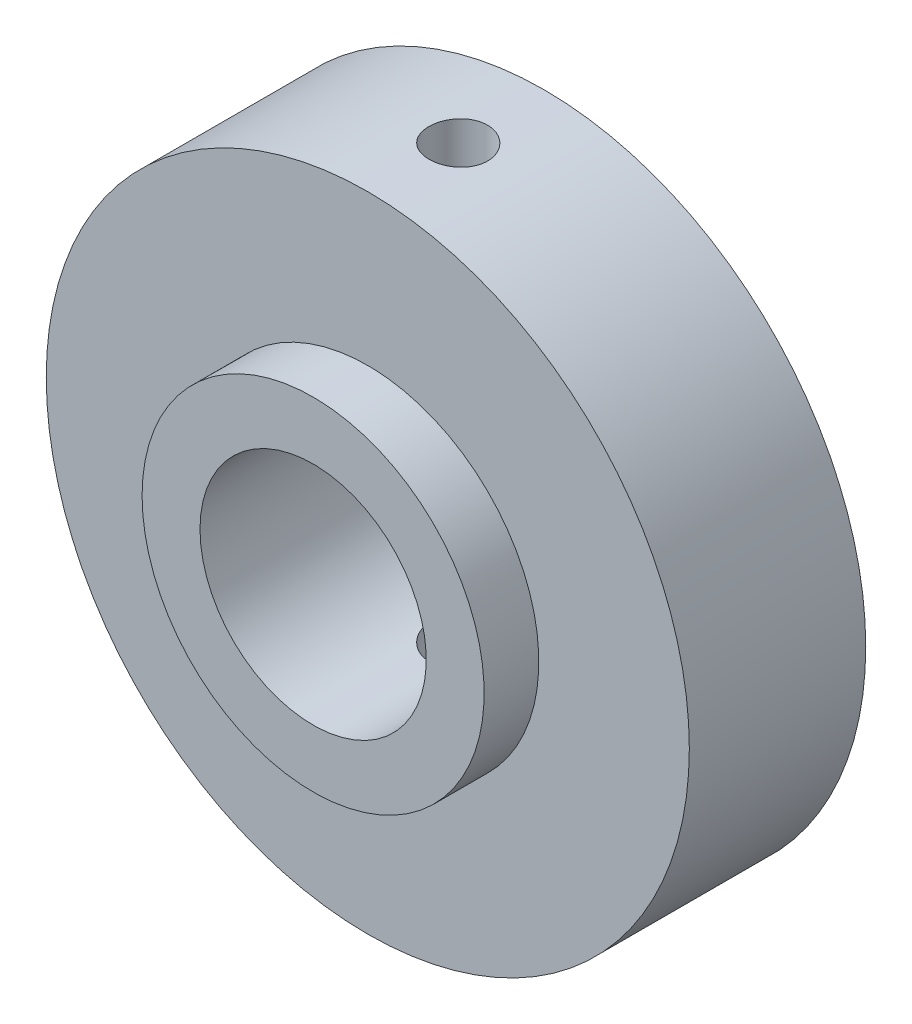
ISO-10303-21;
HEADER;
FILE_DESCRIPTION(('STEP AP214'),'2;1');
FILE_NAME('part.step','',(''),(''),'','','');
FILE_SCHEMA(('AUTOMOTIVE_DESIGN { 1 0 10303 214 1 1 1 1 }'));
ENDSEC;
DATA;
#1=APPLICATION_CONTEXT('core data for automotive mechanical design processes');
#2=APPLICATION_PROTOCOL_DEFINITION('international standard','automotive_design',2000,#1);
#3=PRODUCT_CONTEXT('',#1,'mechanical');
#4=PRODUCT('Part','Part','',(#3));
#5=PRODUCT_RELATED_PRODUCT_CATEGORY('part','',(#4));
#6=PRODUCT_DEFINITION_FORMATION('','',#4);
#7=PRODUCT_DEFINITION_CONTEXT('part definition',#1,'design');
#8=PRODUCT_DEFINITION('design','',#6,#7);
#9=PRODUCT_DEFINITION_SHAPE('','',#8);
#10=(LENGTH_UNIT() NAMED_UNIT(*) SI_UNIT(.MILLI.,.METRE.));
#11=(NAMED_UNIT(*) PLANE_ANGLE_UNIT() SI_UNIT($,.RADIAN.));
#12=(NAMED_UNIT(*) SI_UNIT($,.STERADIAN.) SOLID_ANGLE_UNIT());
#13=UNCERTAINTY_MEASURE_WITH_UNIT(LENGTH_MEASURE(1.E-05),#10,'distance_accuracy_value','');
#14=(GEOMETRIC_REPRESENTATION_CONTEXT(3) GLOBAL_UNCERTAINTY_ASSIGNED_CONTEXT((#13)) GLOBAL_UNIT_ASSIGNED_CONTEXT((#10,
#11,#12)) REPRESENTATION_CONTEXT('',''));
#15=CARTESIAN_POINT('',(0.,0.,0.));
#16=DIRECTION('',(0.,0.,1.));
#17=DIRECTION('',(1.,0.,0.));
#18=AXIS2_PLACEMENT_3D('',#15,#16,#17);
#19=CARTESIAN_POINT('',(2.27939817420907,0.,-19.1299357574621));
#20=DIRECTION('',(0.,0.,-1.));
#21=DIRECTION('',(-1.,0.,0.));
#22=AXIS2_PLACEMENT_3D('',#19,#20,#21);
#23=CYLINDRICAL_SURFACE('',#22,4.2);
#24=CARTESIAN_POINT('',(2.36916450926827,-4.1990406053157,9.97870333006424));
#25=CARTESIAN_POINT('',(2.30908968136473,-4.20032400277502,9.9787019049881));
#26=CARTESIAN_POINT('',(2.24897154958322,-4.20030762760035,9.97373041707249));
#27=CARTESIAN_POINT('',(2.13040617264233,-4.19777602059359,9.95398209989588));
#28=CARTESIAN_POINT('',(2.07195970377911,-4.19525964657695,9.93920078980665));
#29=CARTESIAN_POINT('',(1.95846914340547,-4.1881064901748,9.90032001532521));
#30=CARTESIAN_POINT('',(1.90342139848665,-4.18347203127981,9.87623076599255));
#31=CARTESIAN_POINT('',(1.79812709158779,-4.17267098509535,9.81945358318315));
#32=CARTESIAN_POINT('',(1.74788080260334,-4.16650431076064,9.78676516118075));
#33=CARTESIAN_POINT('',(1.65262811359357,-4.1532535605956,9.71304254123455));
#34=CARTESIAN_POINT('',(1.6077298151895,-4.14615521720557,9.67187125969146));
#35=CARTESIAN_POINT('',(1.5253798956176,-4.1319736542956,9.58264622869984));
#36=CARTESIAN_POINT('',(1.48792916949599,-4.12489043669455,9.53459165321222));
#37=CARTESIAN_POINT('',(1.42089085021547,-4.11146668349222,9.43193974508217));
#38=CARTESIAN_POINT('',(1.39145394560894,-4.10514148848191,9.37724177758254));
#39=CARTESIAN_POINT('',(1.34222372492102,-4.09418420429671,9.2635069717043));
#40=CARTESIAN_POINT('',(1.32242911807727,-4.08955188852595,9.20447071528734));
#41=CARTESIAN_POINT('',(1.2933720470979,-4.0826430249451,9.08475287276733));
#42=CARTESIAN_POINT('',(1.28394225392785,-4.08032910498282,9.02411412159373));
#43=CARTESIAN_POINT('',(1.27536436355381,-4.07822719095206,8.90207457420795));
#44=CARTESIAN_POINT('',(1.27621469213219,-4.07843881014215,8.84067389610984));
#45=CARTESIAN_POINT('',(1.28802559698065,-4.08132505015665,8.72033407883735));
#46=CARTESIAN_POINT('',(1.2987554714041,-4.08394346637875,8.66137072668044));
#47=CARTESIAN_POINT('',(1.32964966893837,-4.09123786438272,8.54610557322644));
#48=CARTESIAN_POINT('',(1.34981465243473,-4.09591399018716,8.48980395853438));
#49=CARTESIAN_POINT('',(1.39919656894562,-4.10680981257123,8.38086220687271));
#50=CARTESIAN_POINT('',(1.42849459147304,-4.11304323334002,8.32826026043802));
#51=CARTESIAN_POINT('',(1.49526219442003,-4.12629203287863,8.22863334042558));
#52=CARTESIAN_POINT('',(1.53273312592336,-4.13330754084337,8.18160929093039));
#53=CARTESIAN_POINT('',(1.61594275572465,-4.14748718122783,8.0931955669194));
#54=CARTESIAN_POINT('',(1.66187053786397,-4.15465045407604,8.0519834747932));
#55=CARTESIAN_POINT('',(1.76009031639784,-4.16806575278619,7.97781401369641));
#56=CARTESIAN_POINT('',(1.8123823489876,-4.17431777346514,7.94485669167619));
#57=CARTESIAN_POINT('',(1.92193151828596,-4.18512171951147,7.88816106749903));
#58=CARTESIAN_POINT('',(1.97918973579682,-4.18967327365269,7.86442477832618));
#59=CARTESIAN_POINT('',(2.09701741089378,-4.19645262959776,7.82694839160082));
#60=CARTESIAN_POINT('',(2.15758619725111,-4.19868090062911,7.81320627572057));
#61=CARTESIAN_POINT('',(2.27857943409387,-4.20042407202745,7.79639951379172));
#62=CARTESIAN_POINT('',(2.33896484972576,-4.20000958670731,7.79306051181343));
#63=CARTESIAN_POINT('',(2.45938216869382,-4.19657397308587,7.79637082335916));
#64=CARTESIAN_POINT('',(2.51941409688746,-4.19355303033067,7.80301942591977));
#65=CARTESIAN_POINT('',(2.63670657995778,-4.18518219965468,7.82591308452826));
#66=CARTESIAN_POINT('',(2.69399136490429,-4.17986001394548,7.84204478931996));
#67=CARTESIAN_POINT('',(2.8050136702795,-4.16735554734001,7.88328627198259));
#68=CARTESIAN_POINT('',(2.85875073775466,-4.16017302950064,7.90839719365582));
#69=CARTESIAN_POINT('',(2.9625116404321,-4.1444149227412,7.96754316678434));
#70=CARTESIAN_POINT('',(3.01242180761567,-4.13581112079475,8.00176998444975));
#71=CARTESIAN_POINT('',(3.10588140824028,-4.11815388594009,8.07793381579824));
#72=CARTESIAN_POINT('',(3.14942955734061,-4.10910036273677,8.11987238245166));
#73=CARTESIAN_POINT('',(3.23015076350118,-4.09118909143285,8.21164193817875));
#74=CARTESIAN_POINT('',(3.26711798305836,-4.08234338360589,8.26165671209048));
#75=CARTESIAN_POINT('',(3.33212060856703,-4.06606722542148,8.36740112010558));
#76=CARTESIAN_POINT('',(3.36015664095555,-4.05863667581896,8.42313035303192));
#77=CARTESIAN_POINT('',(3.40616813304737,-4.04610380317133,8.53818856247262));
#78=CARTESIAN_POINT('',(3.42424297267131,-4.04097857893848,8.59747518371865));
#79=CARTESIAN_POINT('',(3.45012175642673,-4.03355813176165,8.71841573112101));
#80=CARTESIAN_POINT('',(3.45792861678358,-4.03126210530435,8.78006898000568));
#81=CARTESIAN_POINT('',(3.46289001570462,-4.02980797433893,8.90157311699276));
#82=CARTESIAN_POINT('',(3.46042359800638,-4.03053820758169,8.9614074836124));
#83=CARTESIAN_POINT('',(3.44578179290803,-4.03479940482155,9.0797696336979));
#84=CARTESIAN_POINT('',(3.43360667447993,-4.03833029122872,9.13829745331446));
#85=CARTESIAN_POINT('',(3.40010311077831,-4.04775460388088,9.25194741592454));
#86=CARTESIAN_POINT('',(3.37884849880001,-4.0536289484755,9.30709301295793));
#87=CARTESIAN_POINT('',(3.32785184893949,-4.06711660915612,9.4130766061428));
#88=CARTESIAN_POINT('',(3.29810841651453,-4.0747302109261,9.46391389274425));
#89=CARTESIAN_POINT('',(3.22985568589694,-4.09119774538395,9.56161551088891));
#90=CARTESIAN_POINT('',(3.19109380780374,-4.10008384932171,9.60829797555299));
#91=CARTESIAN_POINT('',(3.10639919637252,-4.11800193372561,9.69461424584946));
#92=CARTESIAN_POINT('',(3.06046451821956,-4.12703395315769,9.73424613355322));
#93=CARTESIAN_POINT('',(2.96132105885069,-4.14458402477285,9.80634221039977));
#94=CARTESIAN_POINT('',(2.90795591001991,-4.15308294967174,9.838596457779));
#95=CARTESIAN_POINT('',(2.79634572964744,-4.1684444126604,9.89361929298926));
#96=CARTESIAN_POINT('',(2.73810383073173,-4.17530799049695,9.91639391484439));
#97=CARTESIAN_POINT('',(2.6282712006954,-4.18578719121034,9.94880444574513));
#98=CARTESIAN_POINT('',(2.57716473610335,-4.18975155754744,9.95998644187686));
#99=CARTESIAN_POINT('',(2.47377121227886,-4.19581930044424,9.97493609717934));
#100=CARTESIAN_POINT('',(2.42148428343143,-4.19792288151064,9.97870457117744));
#101=CARTESIAN_POINT('',(2.36916450926827,-4.1990406053157,9.97870333006424));
#102=B_SPLINE_CURVE_WITH_KNOTS('',3,(#24,#25,#26,#27,#28,#29,#30,#31,#32,#33,#34,#35,#36,#37,
#38,#39,#40,#41,#42,#43,#44,#45,#46,#47,#48,#49,#50,#51,#52,#53,#54,#55,#56,#57,#58,#59,#60,#61,
#62,#63,#64,#65,#66,#67,#68,#69,#70,#71,#72,#73,#74,#75,#76,#77,#78,#79,#80,#81,#82,#83,#84,#85,
#86,#87,#88,#89,#90,#91,#92,#93,#94,#95,#96,#97,#98,#99,#100,#101),.UNSPECIFIED.,.T.,.F.,(4,2,2,
2,2,2,2,2,2,2,2,2,2,2,2,2,2,2,2,2,2,2,2,2,2,2,2,2,2,2,2,2,2,2,2,2,2,2,4),(0.,0.18007502558314,
0.360232360620954,0.540192539799766,0.720162944864024,0.903308922547161,1.08647689735608,
1.27288252282498,1.45926318831693,1.64258860923645,1.82588595748712,2.00500871062745,
2.18414400286769,2.36491740179744,2.54572070750449,2.7312092354465,2.9166988183609,
3.10222887158286,3.28772144651613,3.4682788260334,3.64882335325884,3.8272524988207,
4.00570438137812,4.18825594662214,4.37084431392734,4.55840360166187,4.74594973101549,
4.93158923491582,5.11717600364788,5.29597717218504,5.47477338734661,5.65214253269197,
5.82954083301488,6.01268137359802,6.1958716569443,6.38376108135353,6.57153072576801,
6.72837712376708,6.88520628166433),.UNSPECIFIED.);
#103=CARTESIAN_POINT('',(2.36916450926827,-4.1990406053157,9.97870333006424));
#104=VERTEX_POINT('',#103);
#105=EDGE_CURVE('E81',#104,#104,#102,.T.);
#106=ORIENTED_EDGE('',*,*,#105,.T.);
#107=EDGE_LOOP('',(#106));
#108=FACE_BOUND('',#107,.T.);
#109=CARTESIAN_POINT('',(2.36916450926827,4.1990406053157,9.97870333006424));
#110=CARTESIAN_POINT('',(2.42963757968901,4.1977467786429,9.97870167914722));
#111=CARTESIAN_POINT('',(2.49010053717603,4.19513524614943,9.97366386263455));
#112=CARTESIAN_POINT('',(2.60923052145571,4.18745517896644,9.95370601930152));
#113=CARTESIAN_POINT('',(2.66789649569843,4.18238523249667,9.93878031240942));
#114=CARTESIAN_POINT('',(2.78169851662806,4.17024775006006,9.8995844408794));
#115=CARTESIAN_POINT('',(2.83683939855755,4.16318302563462,9.87532741096685));
#116=CARTESIAN_POINT('',(2.94225001543771,4.14770650765819,9.81820552063047));
#117=CARTESIAN_POINT('',(2.99251950654273,4.13929464672988,9.78534022961029));
#118=CARTESIAN_POINT('',(3.08799274637297,4.12172114704041,9.71107852714241));
#119=CARTESIAN_POINT('',(3.13306033796131,4.11254706469467,9.6695099677626));
#120=CARTESIAN_POINT('',(3.21565766066102,4.09453405393278,9.57938648938593));
#121=CARTESIAN_POINT('',(3.25318646394805,4.08569516687872,9.53083071170898));
#122=CARTESIAN_POINT('',(3.32015244002187,4.06915729329956,9.42722566028378));
#123=CARTESIAN_POINT('',(3.34946572721571,4.06147649095841,9.37209317986088));
#124=CARTESIAN_POINT('',(3.39834043726066,4.04828528297802,9.25742090049817));
#125=CARTESIAN_POINT('',(3.41790401609747,4.04277439755439,9.19788207929479));
#126=CARTESIAN_POINT('',(3.44619881241937,4.03469810835786,9.0778093504345));
#127=CARTESIAN_POINT('',(3.45521083452631,4.0320564917719,9.01734683529807));
#128=CARTESIAN_POINT('',(3.46302367494481,4.02977032275158,8.8957148541486));
#129=CARTESIAN_POINT('',(3.46182655376729,4.03012516554181,8.83454553327888));
#130=CARTESIAN_POINT('',(3.44946310587874,4.03373094921889,8.71519289990132));
#131=CARTESIAN_POINT('',(3.43859913247122,4.03689404868021,8.65697521234267));
#132=CARTESIAN_POINT('',(3.40768999988643,4.04564124481356,8.54322474505815));
#133=CARTESIAN_POINT('',(3.3876440727665,4.05122554398317,8.48769219033585));
#134=CARTESIAN_POINT('',(3.33868433550494,4.06430307616737,8.38007286663711));
#135=CARTESIAN_POINT('',(3.30966117056022,4.07181964474039,8.32803879617269));
#136=CARTESIAN_POINT('',(3.24365715229258,4.08795253916236,8.22947735149101));
#137=CARTESIAN_POINT('',(3.2066746190375,4.09656909702247,8.18295114300073));
#138=CARTESIAN_POINT('',(3.12421633463116,4.11437985561666,8.09494534227759));
#139=CARTESIAN_POINT('',(3.07848038936085,4.12358366560242,8.05371115238587));
#140=CARTESIAN_POINT('',(2.98065448201603,4.14134127758186,7.97944630188174));
#141=CARTESIAN_POINT('',(2.92856408738319,4.14989503526098,7.94641620020094));
#142=CARTESIAN_POINT('',(2.81893823287503,4.16557117218395,7.88927973649752));
#143=CARTESIAN_POINT('',(2.76136183343172,4.17268130992283,7.86524834272776));
#144=CARTESIAN_POINT('',(2.6427500911995,4.18467721890759,7.82729286880445));
#145=CARTESIAN_POINT('',(2.58171547969253,4.18956345846496,7.81336666031983));
#146=CARTESIAN_POINT('',(2.45975780798342,4.19655757585806,7.79637626394917));
#147=CARTESIAN_POINT('',(2.39888011724632,4.1987399012637,7.79301690818159));
#148=CARTESIAN_POINT('',(2.27738081362438,4.20043875335396,7.79647173902724));
#149=CARTESIAN_POINT('',(2.21675916963778,4.19995561370783,7.80328465217381));
#150=CARTESIAN_POINT('',(2.09880011681435,4.19652204615122,7.82662363583095));
#151=CARTESIAN_POINT('',(2.04142074540259,4.193622753232,7.84294630697038));
#152=CARTESIAN_POINT('',(1.93019542057724,4.18582946242053,7.88463747222057));
#153=CARTESIAN_POINT('',(1.87634976193811,4.1809352983655,7.91000671984381));
#154=CARTESIAN_POINT('',(1.77283943879362,4.16967039821049,7.96949034645866));
#155=CARTESIAN_POINT('',(1.72324760264298,4.16327907602823,8.00372742502064));
#156=CARTESIAN_POINT('',(1.63040239550223,4.14982036259361,8.07982152006606));
#157=CARTESIAN_POINT('',(1.58715012806785,4.14275285398765,8.12167986037823));
#158=CARTESIAN_POINT('',(1.50705368273734,4.12858137700463,8.21311330820553));
#159=CARTESIAN_POINT('',(1.47040503488412,4.12148122612512,8.26286055130975));
#160=CARTESIAN_POINT('',(1.40595785709558,4.10830720776388,8.36791780257806));
#161=CARTESIAN_POINT('',(1.37815914960753,4.10223331969381,8.42322769911161));
#162=CARTESIAN_POINT('',(1.33230292768253,4.09189020929714,8.53776969276405));
#163=CARTESIAN_POINT('',(1.31422368204126,4.08761696567746,8.59699270476795));
#164=CARTESIAN_POINT('',(1.28831457621332,4.08141322760478,8.71775508859712));
#165=CARTESIAN_POINT('',(1.28048265390546,4.07948226180895,8.77929399181873));
#166=CARTESIAN_POINT('',(1.27540504021999,4.07823537030298,8.90121509919237));
#167=CARTESIAN_POINT('',(1.27788776667012,4.07885235508206,8.96158544747519));
#168=CARTESIAN_POINT('',(1.29274208848654,4.08247069989533,9.08102035414062));
#169=CARTESIAN_POINT('',(1.3051135003492,4.08547201568365,9.14008493673333));
#170=CARTESIAN_POINT('',(1.33923687247978,4.09345802788351,9.25489994585459));
#171=CARTESIAN_POINT('',(1.36093203961721,4.09843070230153,9.3106681486186));
#172=CARTESIAN_POINT('',(1.4130470315117,4.10976199093292,9.41781359984723));
#173=CARTESIAN_POINT('',(1.44346803434735,4.11612079226,9.46919025419061));
#174=CARTESIAN_POINT('',(1.51304014625929,4.12964619273084,9.56743023602342));
#175=CARTESIAN_POINT('',(1.55238402955395,4.13682856982323,9.61415490656889));
#176=CARTESIAN_POINT('',(1.63832138696516,4.15101356190945,9.70043034275606));
#177=CARTESIAN_POINT('',(1.68491638628581,4.15801613872215,9.73997959531678));
#178=CARTESIAN_POINT('',(1.78488322372274,4.17109465209995,9.81135136608021));
#179=CARTESIAN_POINT('',(1.83834573077305,4.17715521895111,9.84304991182452));
#180=CARTESIAN_POINT('',(1.94999379781954,4.18743660049433,9.89696547621222));
#181=CARTESIAN_POINT('',(2.00817600356906,4.19165870840642,9.9191891594908));
#182=CARTESIAN_POINT('',(2.11673074161061,4.19713467809424,9.95034836453871));
#183=CARTESIAN_POINT('',(2.16660824578125,4.19878774013216,9.96096194982498));
#184=CARTESIAN_POINT('',(2.26738110397591,4.20028501899908,9.97513988298115));
#185=CARTESIAN_POINT('',(2.31827638722346,4.20012936117301,9.97870471931183));
#186=CARTESIAN_POINT('',(2.36916450926827,4.1990406053157,9.97870333006424));
#187=B_SPLINE_CURVE_WITH_KNOTS('',3,(#109,#110,#111,#112,#113,#114,#115,#116,#117,#118,#119,
#120,#121,#122,#123,#124,#125,#126,#127,#128,#129,#130,#131,#132,#133,#134,#135,#136,#137,#138,
#139,#140,#141,#142,#143,#144,#145,#146,#147,#148,#149,#150,#151,#152,#153,#154,#155,#156,#157,
#158,#159,#160,#161,#162,#163,#164,#165,#166,#167,#168,#169,#170,#171,#172,#173,#174,#175,#176,
#177,#178,#179,#180,#181,#182,#183,#184,#185,#186),.UNSPECIFIED.,.T.,.F.,(4,2,2,2,2,2,2,2,2,2,2,
2,2,2,2,2,2,2,2,2,2,2,2,2,2,2,2,2,2,2,2,2,2,2,2,2,2,2,4),(0.,0.18127293963861,0.362650101424274,
0.543772886292683,0.724904732888097,0.910030943724982,1.09517992473422,1.28298665527005,
1.47075183702573,1.65339753443547,1.83600636934507,2.01309693541829,2.19020231535822,
2.36955621103746,2.54894799896733,2.73487092724041,2.92080651867762,3.10825838580576,
3.29567076078042,3.47779934212607,3.65990512470047,3.83825192621125,4.01661358615398,
4.19758887316403,4.37859562599354,4.56430188725696,4.75000442253654,4.9352900105891,
5.12053830693926,5.30094039658354,5.48133913859676,5.66065426766669,5.83999361754852,
6.02365621806359,6.20735750262661,6.39379725210374,6.58010564229205,6.73265749260889,
6.88519877109155),.UNSPECIFIED.);
#188=CARTESIAN_POINT('',(2.36916450926827,4.1990406053157,9.97870333006424));
#189=VERTEX_POINT('',#188);
#190=EDGE_CURVE('E77',#189,#189,#187,.T.);
#191=ORIENTED_EDGE('',*,*,#190,.T.);
#192=EDGE_LOOP('',(#191));
#193=FACE_BOUND('',#192,.T.);
#194=CARTESIAN_POINT('',(2.27939817420908,0.,14.185436756577));
#195=DIRECTION('',(0.,0.,-1.));
#196=DIRECTION('',(-1.,0.,0.));
#197=AXIS2_PLACEMENT_3D('',#194,#195,#196);
#198=CIRCLE('',#197,4.2);
#199=CARTESIAN_POINT('',(-1.92060182579092,0.,14.185436756577));
#200=VERTEX_POINT('',#199);
#201=EDGE_CURVE('E86',#200,#200,#198,.T.);
#202=ORIENTED_EDGE('',*,*,#201,.F.);
#203=EDGE_LOOP('',(#202));
#204=FACE_BOUND('',#203,.T.);
#205=CARTESIAN_POINT('',(2.27939817420908,0.,3.57343675657702));
#206=DIRECTION('',(0.,0.,-1.));
#207=DIRECTION('',(-1.,0.,0.));
#208=AXIS2_PLACEMENT_3D('',#205,#206,#207);
#209=CIRCLE('',#208,4.2);
#210=CARTESIAN_POINT('',(-1.92060182579092,0.,3.57343675657702));
#211=VERTEX_POINT('',#210);
#212=EDGE_CURVE('E51',#211,#211,#209,.T.);
#213=ORIENTED_EDGE('',*,*,#212,.T.);
#214=EDGE_LOOP('',(#213));
#215=FACE_BOUND('',#214,.T.);
#216=ADVANCED_FACE('F36',(#108,#193,#204,#215),#23,.F.);
#217=CARTESIAN_POINT('',(0.,0.,3.57343675657701));
#218=DIRECTION('',(0.,0.,-1.));
#219=DIRECTION('',(-1.,0.,0.));
#220=AXIS2_PLACEMENT_3D('',#217,#218,#219);
#221=PLANE('',#220);
#222=CARTESIAN_POINT('',(2.27939817420908,0.,3.57343675657702));
#223=DIRECTION('',(0.,0.,-1.));
#224=DIRECTION('',(-1.,0.,0.));
#225=AXIS2_PLACEMENT_3D('',#222,#223,#224);
#226=CIRCLE('',#225,6.35);
#227=CARTESIAN_POINT('',(-4.07060182579092,0.,3.57343675657702));
#228=VERTEX_POINT('',#227);
#229=EDGE_CURVE('E55',#228,#228,#226,.T.);
#230=ORIENTED_EDGE('',*,*,#229,.T.);
#231=EDGE_LOOP('',(#230));
#232=FACE_BOUND('',#231,.T.);
#233=ORIENTED_EDGE('',*,*,#212,.F.);
#234=EDGE_LOOP('',(#233));
#235=FACE_BOUND('',#234,.T.);
#236=ADVANCED_FACE('F106',(#232,#235),#221,.T.);
#237=CARTESIAN_POINT('',(2.27939817420907,0.,-19.1299357574621));
#238=DIRECTION('',(0.,0.,-1.));
#239=DIRECTION('',(-1.,0.,0.));
#240=AXIS2_PLACEMENT_3D('',#237,#238,#239);
#241=CYLINDRICAL_SURFACE('',#240,6.35);
#242=ORIENTED_EDGE('',*,*,#229,.F.);
#243=EDGE_LOOP('',(#242));
#244=FACE_BOUND('',#243,.T.);
#245=CARTESIAN_POINT('',(2.27939817420908,0.,5.60543675657701));
#246=DIRECTION('',(0.,0.,-1.));
#247=DIRECTION('',(-1.,0.,0.));
#248=AXIS2_PLACEMENT_3D('',#245,#246,#247);
#249=CIRCLE('',#248,6.35);
#250=CARTESIAN_POINT('',(-4.07060182579092,0.,5.60543675657702));
#251=VERTEX_POINT('',#250);
#252=EDGE_CURVE('E101',#251,#251,#249,.T.);
#253=ORIENTED_EDGE('',*,*,#252,.T.);
#254=EDGE_LOOP('',(#253));
#255=FACE_BOUND('',#254,.T.);
#256=ADVANCED_FACE('F109',(#244,#255),#241,.T.);
#257=CARTESIAN_POINT('',(0.,0.,5.60543675657701));
#258=DIRECTION('',(0.,0.,-1.));
#259=DIRECTION('',(-1.,0.,0.));
#260=AXIS2_PLACEMENT_3D('',#257,#258,#259);
#261=PLANE('',#260);
#262=CARTESIAN_POINT('',(2.27939817420908,0.,5.60543675657701));
#263=DIRECTION('',(0.,0.,-1.));
#264=DIRECTION('',(-1.,0.,0.));
#265=AXIS2_PLACEMENT_3D('',#262,#263,#264);
#266=CIRCLE('',#265,11.938);
#267=CARTESIAN_POINT('',(-9.65860182579092,0.,5.60543675657702));
#268=VERTEX_POINT('',#267);
#269=EDGE_CURVE('E98',#268,#268,#266,.T.);
#270=ORIENTED_EDGE('',*,*,#269,.T.);
#271=EDGE_LOOP('',(#270));
#272=FACE_BOUND('',#271,.T.);
#273=ORIENTED_EDGE('',*,*,#252,.F.);
#274=EDGE_LOOP('',(#273));
#275=FACE_BOUND('',#274,.T.);
#276=ADVANCED_FACE('F112',(#272,#275),#261,.T.);
#277=CARTESIAN_POINT('',(2.27939817420907,0.,-19.1299357574621));
#278=DIRECTION('',(0.,0.,-1.));
#279=DIRECTION('',(-1.,0.,0.));
#280=AXIS2_PLACEMENT_3D('',#277,#278,#279);
#281=CYLINDRICAL_SURFACE('',#280,11.938);
#282=CARTESIAN_POINT('',(2.27939817420908,-11.938,7.7979984632446));
#283=CARTESIAN_POINT('',(2.21837354321615,-11.9379993774013,7.8030336880568));
#284=CARTESIAN_POINT('',(2.15773205568773,-11.937527177792,7.81321611489547));
#285=CARTESIAN_POINT('',(2.03897808763387,-11.9357270956912,7.84360237598854));
#286=CARTESIAN_POINT('',(1.9808685326469,-11.9343982499819,7.86381748515365));
#287=CARTESIAN_POINT('',(1.86890298857663,-11.9310717808842,7.91367697581097));
#288=CARTESIAN_POINT('',(1.81504453131312,-11.9290745491423,7.94331583486896));
#289=CARTESIAN_POINT('',(1.71307524602721,-11.9246690103928,8.01117578479581));
#290=CARTESIAN_POINT('',(1.6649632115341,-11.9222607899316,8.04939506932104));
#291=CARTESIAN_POINT('',(1.57570220152969,-11.9173261794758,8.1334521307457));
#292=CARTESIAN_POINT('',(1.53457146998276,-11.9147995012349,8.17930926677583));
#293=CARTESIAN_POINT('',(1.46058258466666,-11.9099439135921,8.27728393045914));
#294=CARTESIAN_POINT('',(1.42772475466794,-11.9076150119328,8.32940170301236));
#295=CARTESIAN_POINT('',(1.37118904762857,-11.9034368218674,8.43848208787241));
#296=CARTESIAN_POINT('',(1.34752010095949,-11.9015880006104,8.49544934801957));
#297=CARTESIAN_POINT('',(1.31008962415316,-11.8985982471561,8.61256815281294));
#298=CARTESIAN_POINT('',(1.29632788228406,-11.8974572998307,8.67271962937818));
#299=CARTESIAN_POINT('',(1.27913605978165,-11.8960243403076,8.79431635982863));
#300=CARTESIAN_POINT('',(1.27567667574143,-11.8957299203809,8.85575744266387));
#301=CARTESIAN_POINT('',(1.27910697154321,-11.8960188404946,8.9783472672412));
#302=CARTESIAN_POINT('',(1.28599650824907,-11.8966021683948,9.03949601301486));
#303=CARTESIAN_POINT('',(1.30990152311004,-11.8985739436777,9.15964775853648));
#304=CARTESIAN_POINT('',(1.32689809470776,-11.8999608876654,9.21865454697971));
#305=CARTESIAN_POINT('',(1.37051328420284,-11.9033712740333,9.3329781776167));
#306=CARTESIAN_POINT('',(1.39713206324931,-11.9053947270735,9.38829495799322));
#307=CARTESIAN_POINT('',(1.45930437367033,-11.9098387741759,9.4938030822747));
#308=CARTESIAN_POINT('',(1.49487745914295,-11.9122602333207,9.54398286636388));
#309=CARTESIAN_POINT('',(1.57392554888615,-11.9172025354528,9.63767075459034));
#310=CARTESIAN_POINT('',(1.61740069400278,-11.9197233802108,9.68117873978422));
#311=CARTESIAN_POINT('',(1.71115732743075,-11.9245608332105,9.76040489522598));
#312=CARTESIAN_POINT('',(1.76145644206461,-11.9268768860021,9.79610224519218));
#313=CARTESIAN_POINT('',(1.86735344531123,-11.9310044361895,9.85854483159164));
#314=CARTESIAN_POINT('',(1.92295128030824,-11.9328159386899,9.8852901585947));
#315=CARTESIAN_POINT('',(2.03778835152581,-11.9356926904375,9.92902934216155));
#316=CARTESIAN_POINT('',(2.09702237245775,-11.9367589825196,9.94603681965486));
#317=CARTESIAN_POINT('',(2.21751359721404,-11.9379915474381,9.96986573429183));
#318=CARTESIAN_POINT('',(2.27877075221294,-11.9381578419788,9.97668741707175));
#319=CARTESIAN_POINT('',(2.40134538336588,-11.9375339292125,9.97994344685771));
#320=CARTESIAN_POINT('',(2.46266193936078,-11.9367469859564,9.97641318204029));
#321=CARTESIAN_POINT('',(2.58382194490059,-11.9342717788033,9.95914843432179));
#322=CARTESIAN_POINT('',(2.64366539381512,-11.9325835145206,9.94541394705416));
#323=CARTESIAN_POINT('',(2.76019261475005,-11.9284568398096,9.90813940168081));
#324=CARTESIAN_POINT('',(2.81687614874339,-11.9260183729606,9.88459860602338));
#325=CARTESIAN_POINT('',(2.92549150965816,-11.9206278263574,9.82838479872605));
#326=CARTESIAN_POINT('',(2.9774232128635,-11.9176757332365,9.79571154940828));
#327=CARTESIAN_POINT('',(3.07527587309752,-11.9115422706759,9.72201134570343));
#328=CARTESIAN_POINT('',(3.12117295659298,-11.9083600634912,9.68095276137205));
#329=CARTESIAN_POINT('',(3.20543335709697,-11.9021045252017,9.59171339134216));
#330=CARTESIAN_POINT('',(3.24379656677292,-11.8990311956484,9.54353250419173));
#331=CARTESIAN_POINT('',(3.31196992026111,-11.8933097208245,9.44130104994459));
#332=CARTESIAN_POINT('',(3.34176369564197,-11.8906623934499,9.38723951804228));
#333=CARTESIAN_POINT('',(3.39184328803136,-11.8860820158601,9.27485049130036));
#334=CARTESIAN_POINT('',(3.4121293245389,-11.8841489491555,9.21652309497996));
#335=CARTESIAN_POINT('',(3.44255354537586,-11.8812098966247,9.09745470519128));
#336=CARTESIAN_POINT('',(3.4527238842434,-11.8802009740565,9.03672200167438));
#337=CARTESIAN_POINT('',(3.46273100794371,-11.8792084570567,8.91440341179092));
#338=CARTESIAN_POINT('',(3.46256803667739,-11.8792248384245,8.85281754559616));
#339=CARTESIAN_POINT('',(3.45193403483978,-11.8802790822015,8.73078411313256));
#340=CARTESIAN_POINT('',(3.44150145271689,-11.8813131345439,8.67033315803267));
#341=CARTESIAN_POINT('',(3.41068946611037,-11.8842863182276,8.55204547293126));
#342=CARTESIAN_POINT('',(3.39030996340096,-11.8862254585066,8.49420876875163));
#343=CARTESIAN_POINT('',(3.34015831802541,-11.8908058323764,8.38270385406285));
#344=CARTESIAN_POINT('',(3.31037414639805,-11.893447964438,8.32904109236643));
#345=CARTESIAN_POINT('',(3.24226803884449,-11.8991549781606,8.22746604325905));
#346=CARTESIAN_POINT('',(3.20394615961635,-11.9022198570141,8.17955371766326));
#347=CARTESIAN_POINT('',(3.1196581996434,-11.9084674216243,8.09062044244451));
#348=CARTESIAN_POINT('',(3.07366012890061,-11.9116505551355,8.04962984045035));
#349=CARTESIAN_POINT('',(2.97541383996397,-11.9177944365538,7.97593553736555));
#350=CARTESIAN_POINT('',(2.92316414671933,-11.9207551317079,7.94323379770446));
#351=CARTESIAN_POINT('',(2.81381515268114,-11.9261578956922,7.88701683302627));
#352=CARTESIAN_POINT('',(2.75670858180853,-11.9285991671885,7.86351568545912));
#353=CARTESIAN_POINT('',(2.63937410402356,-11.9327152898635,7.82647309489353));
#354=CARTESIAN_POINT('',(2.57914985386562,-11.9343910172543,7.81292025460967));
#355=CARTESIAN_POINT('',(2.47871217625045,-11.9364019306389,7.79907667105389));
#356=CARTESIAN_POINT('',(2.43889087429188,-11.9370011675617,7.79580128938432));
#357=CARTESIAN_POINT('',(2.35912483078674,-11.937800404376,7.79362096444112));
#358=CARTESIAN_POINT('',(2.3191800897368,-11.9380004058717,7.79471600360687));
#359=CARTESIAN_POINT('',(2.27939817420908,-11.938,7.7979984632446));
#360=B_SPLINE_CURVE_WITH_KNOTS('',3,(#282,#283,#284,#285,#286,#287,#288,#289,#290,#291,#292,
#293,#294,#295,#296,#297,#298,#299,#300,#301,#302,#303,#304,#305,#306,#307,#308,#309,#310,#311,
#312,#313,#314,#315,#316,#317,#318,#319,#320,#321,#322,#323,#324,#325,#326,#327,#328,#329,#330,
#331,#332,#333,#334,#335,#336,#337,#338,#339,#340,#341,#342,#343,#344,#345,#346,#347,#348,#349,
#350,#351,#352,#353,#354,#355,#356,#357,#358,#359),.UNSPECIFIED.,.T.,.F.,(4,2,2,2,2,2,2,2,2,2,2,
2,2,2,2,2,2,2,2,2,2,2,2,2,2,2,2,2,2,2,2,2,2,2,2,2,2,2,4),(0.,0.18355022100133,0.367307187769338,
0.550956668534651,0.734567523765373,0.918651051532127,1.10274178252069,1.2870109799755,
1.47127623920402,1.65501688244533,1.83875498438912,2.02215045616177,2.20554899951506,
2.38935157038326,2.57315741766357,2.75744741075222,2.94173553927795,3.12576525892531,
3.30979054051915,3.49318746509739,3.67658446815435,3.85999526735112,4.04341084037402,
4.22753148760019,4.41165475774145,4.59612742003184,4.78059582331142,4.9644759689896,
5.14835177447878,5.33154177458488,5.51473358372773,5.69816065842692,5.8815865150417,
6.06579680281308,6.25005064045603,6.43458530573676,6.61890822736796,6.73856497265333,
6.8582212371511),.UNSPECIFIED.);
#361=CARTESIAN_POINT('',(2.27939817420908,-11.938,7.7979984632446));
#362=VERTEX_POINT('',#361);
#363=EDGE_CURVE('E10',#362,#362,#360,.T.);
#364=ORIENTED_EDGE('',*,*,#363,.T.);
#365=EDGE_LOOP('',(#364));
#366=FACE_BOUND('',#365,.T.);
#367=CARTESIAN_POINT('',(2.36916450926827,11.9376625017249,9.97870333006424));
#368=CARTESIAN_POINT('',(2.30797740911116,11.9381219559611,9.97870067315979));
#369=CARTESIAN_POINT('',(2.24674580438916,11.93810758483,9.97354432711534));
#370=CARTESIAN_POINT('',(2.12597102850619,11.9371672918499,9.95304797164745));
#371=CARTESIAN_POINT('',(2.06642980865939,11.9362403573433,9.93769665517958));
#372=CARTESIAN_POINT('',(1.95080268015766,11.933616881156,9.8972564537437));
#373=CARTESIAN_POINT('',(1.89471484383411,11.9319207733311,9.87217305935077));
#374=CARTESIAN_POINT('',(1.78755585389186,11.9279844817629,9.81299054593427));
#375=CARTESIAN_POINT('',(1.7364836683244,11.9257444102686,9.77889328682723));
#376=CARTESIAN_POINT('',(1.64065240852592,11.920996562786,9.70255042415757));
#377=CARTESIAN_POINT('',(1.5959090312912,11.9184881473679,9.66028515508721));
#378=CARTESIAN_POINT('',(1.5141388741937,11.9135177261128,9.5688478652507));
#379=CARTESIAN_POINT('',(1.47711244642926,11.9110557223981,9.51967552950971));
#380=CARTESIAN_POINT('',(1.41175790225478,11.9064740230656,9.41570198488561));
#381=CARTESIAN_POINT('',(1.383447284999,11.9043550200979,9.36088974293247));
#382=CARTESIAN_POINT('',(1.33643595861451,11.9007237362822,9.24726960605035));
#383=CARTESIAN_POINT('',(1.31773508540562,11.8992114450751,9.18846177936279));
#384=CARTESIAN_POINT('',(1.29051432074305,11.8969803220578,9.06865666878648));
#385=CARTESIAN_POINT('',(1.28197211012326,11.896259751059,9.00766448912594));
#386=CARTESIAN_POINT('',(1.27524263573367,11.8956936596054,8.88510814913568));
#387=CARTESIAN_POINT('',(1.27705517148361,11.8958481222089,8.823543999903));
#388=CARTESIAN_POINT('',(1.29096339826004,11.89701172781,8.70176134608754));
#389=CARTESIAN_POINT('',(1.30303212513787,11.8980186296668,8.64153973753873));
#390=CARTESIAN_POINT('',(1.33706842132474,11.9007624825042,8.52397977130114));
#391=CARTESIAN_POINT('',(1.359036097646,11.9024994413771,8.46664144478942));
#392=CARTESIAN_POINT('',(1.412277467372,11.9064963646394,8.3563896513517));
#393=CARTESIAN_POINT('',(1.44356327940617,11.9087570092482,8.3034820622975));
#394=CARTESIAN_POINT('',(1.51454496288349,11.9135261220995,8.20365835378081));
#395=CARTESIAN_POINT('',(1.55424101039921,11.9160345955298,8.15674235978839));
#396=CARTESIAN_POINT('',(1.64106312386779,11.9210009788029,8.0700826805305));
#397=CARTESIAN_POINT('',(1.68821169616633,11.9234587091277,8.0303615294422));
#398=CARTESIAN_POINT('',(1.78852233290475,11.9280091102504,7.9593948839301));
#399=CARTESIAN_POINT('',(1.84168438338092,11.9301017818961,7.92814936982586));
#400=CARTESIAN_POINT('',(1.95250340121325,11.9336521086089,7.87503478794803));
#401=CARTESIAN_POINT('',(2.01015899798947,11.9351099564175,7.85316287425069));
#402=CARTESIAN_POINT('',(2.12833886765533,11.9371904184098,7.81941384226375));
#403=CARTESIAN_POINT('',(2.18886307005131,11.9378130531073,7.80753647850053));
#404=CARTESIAN_POINT('',(2.31083761770643,11.9381138137719,7.79414341575742));
#405=CARTESIAN_POINT('',(2.37228404627282,11.9377951916604,7.79259210190894));
#406=CARTESIAN_POINT('',(2.49455655056253,11.9362175573735,7.79979810082872));
#407=CARTESIAN_POINT('',(2.55538263107662,11.934958552466,7.80855533392617));
#408=CARTESIAN_POINT('',(2.67462095623137,11.9316050217493,7.83610467145227));
#409=CARTESIAN_POINT('',(2.73303582542127,11.9295114323286,7.85488553752355));
#410=CARTESIAN_POINT('',(2.84588310725308,11.9246858066065,7.90193364217078));
#411=CARTESIAN_POINT('',(2.90031543105769,11.921953756069,7.93020109228224));
#412=CARTESIAN_POINT('',(3.00385046237454,11.9161115354519,7.99552979464289));
#413=CARTESIAN_POINT('',(3.05293486553164,11.9130001394933,8.03261994594383));
#414=CARTESIAN_POINT('',(3.14419301388754,11.9067237421317,8.11449949684955));
#415=CARTESIAN_POINT('',(3.18636661239498,11.9035587395926,8.1592890598436));
#416=CARTESIAN_POINT('',(3.26273097739971,11.897494540778,8.25545610595186));
#417=CARTESIAN_POINT('',(3.29689796389599,11.8945961514621,8.30685252886756));
#418=CARTESIAN_POINT('',(3.35611347020652,11.8893824723746,8.41468154125792));
#419=CARTESIAN_POINT('',(3.38116212916868,11.8870671737049,8.47111405386425));
#420=CARTESIAN_POINT('',(3.42137377223507,11.8832716713354,8.58729249318839));
#421=CARTESIAN_POINT('',(3.43655734288136,11.8817897294555,8.64703123570378));
#422=CARTESIAN_POINT('',(3.45667734069183,11.8798131976676,8.76822560289304));
#423=CARTESIAN_POINT('',(3.46161405003539,11.8793185805706,8.82968118024126));
#424=CARTESIAN_POINT('',(3.46109661006893,11.8793700433649,8.95228490860666));
#425=CARTESIAN_POINT('',(3.4556866839472,11.8799116940838,9.01343325299065));
#426=CARTESIAN_POINT('',(3.43472204394811,11.8819686969451,9.13394793160042));
#427=CARTESIAN_POINT('',(3.41916732251106,11.8834840498131,9.19331426449825));
#428=CARTESIAN_POINT('',(3.37836663753872,11.8873264098014,9.30858084310146));
#429=CARTESIAN_POINT('',(3.35312172943564,11.8896533285254,9.36448146551393));
#430=CARTESIAN_POINT('',(3.29366266760668,11.8948727738534,9.47125819412622));
#431=CARTESIAN_POINT('',(3.25944858531431,11.8977652959526,9.52213434033823));
#432=CARTESIAN_POINT('',(3.18285729431175,11.9038264120962,9.61764453216631));
#433=CARTESIAN_POINT('',(3.14044721919428,11.906996088539,9.66225215298093));
#434=CARTESIAN_POINT('',(3.04873330436875,11.9132730837288,9.7437374434752));
#435=CARTESIAN_POINT('',(2.99942778114678,11.9163803870351,9.78061321992443));
#436=CARTESIAN_POINT('',(2.89517343299622,11.9222227887145,9.84567107910518));
#437=CARTESIAN_POINT('',(2.84020928364594,11.9249568271033,9.87382868004211));
#438=CARTESIAN_POINT('',(2.72634383869723,11.929766024271,9.92047662402373));
#439=CARTESIAN_POINT('',(2.6674471057421,11.9318419310799,9.93897795792152));
#440=CARTESIAN_POINT('',(2.56837002078698,11.93456642837,9.9611311397374));
#441=CARTESIAN_POINT('',(2.52882666666534,11.9354603091512,9.96771157295554));
#442=CARTESIAN_POINT('',(2.44925006691402,11.9368579686927,9.97649853068807));
#443=CARTESIAN_POINT('',(2.4092168228571,11.9373617487051,9.9787050692408));
#444=CARTESIAN_POINT('',(2.36916450926827,11.9376625017249,9.97870333006424));
#445=B_SPLINE_CURVE_WITH_KNOTS('',3,(#367,#368,#369,#370,#371,#372,#373,#374,#375,#376,#377,
#378,#379,#380,#381,#382,#383,#384,#385,#386,#387,#388,#389,#390,#391,#392,#393,#394,#395,#396,
#397,#398,#399,#400,#401,#402,#403,#404,#405,#406,#407,#408,#409,#410,#411,#412,#413,#414,#415,
#416,#417,#418,#419,#420,#421,#422,#423,#424,#425,#426,#427,#428,#429,#430,#431,#432,#433,#434,
#435,#436,#437,#438,#439,#440,#441,#442,#443,#444),.UNSPECIFIED.,.T.,.F.,(4,2,2,2,2,2,2,2,2,2,2,
2,2,2,2,2,2,2,2,2,2,2,2,2,2,2,2,2,2,2,2,2,2,2,2,2,2,2,4),(0.,0.18342033207387,0.36704443257849,
0.550565087619034,0.734047904612484,0.917978110473857,1.10191670661274,1.2862222323256,
1.4705246110362,1.65442131429995,1.83831445711614,2.021725624095,2.20513877388089,
2.38879150962863,2.57244809062015,2.75667029455728,2.9408920707266,3.12505787553363,
3.30921915695865,3.49274492976692,3.67626928418428,3.85958830458557,4.04291141297669,
4.22684347795347,4.41077944663614,4.59525497900528,4.77972769611441,4.96381420707498,
5.14789564857044,5.33119205429619,5.51448859661057,5.69776518036129,5.88104030447994,
6.06506622251707,6.24913714891464,6.43372037859828,6.6180930532192,6.73815810318674,
6.8582227677962),.UNSPECIFIED.);
#446=CARTESIAN_POINT('',(2.36916450926827,11.9376625017249,9.97870333006424));
#447=VERTEX_POINT('',#446);
#448=EDGE_CURVE('E47',#447,#447,#445,.T.);
#449=ORIENTED_EDGE('',*,*,#448,.T.);
#450=EDGE_LOOP('',(#449));
#451=FACE_BOUND('',#450,.T.);
#452=ORIENTED_EDGE('',*,*,#269,.F.);
#453=EDGE_LOOP('',(#452));
#454=FACE_BOUND('',#453,.T.);
#455=CARTESIAN_POINT('',(2.27939817420908,0.,12.155436756577));
#456=DIRECTION('',(0.,0.,-1.));
#457=DIRECTION('',(-1.,0.,0.));
#458=AXIS2_PLACEMENT_3D('',#455,#456,#457);
#459=CIRCLE('',#458,11.938);
#460=CARTESIAN_POINT('',(-9.65860182579092,0.,12.155436756577));
#461=VERTEX_POINT('',#460);
#462=EDGE_CURVE('E95',#461,#461,#459,.T.);
#463=ORIENTED_EDGE('',*,*,#462,.T.);
#464=EDGE_LOOP('',(#463));
#465=FACE_BOUND('',#464,.T.);
#466=ADVANCED_FACE('F60',(#366,#451,#454,#465),#281,.T.);
#467=CARTESIAN_POINT('',(0.,0.,12.155436756577));
#468=DIRECTION('',(0.,0.,-1.));
#469=DIRECTION('',(-1.,0.,0.));
#470=AXIS2_PLACEMENT_3D('',#467,#468,#469);
#471=PLANE('',#470);
#472=ORIENTED_EDGE('',*,*,#462,.F.);
#473=EDGE_LOOP('',(#472));
#474=FACE_BOUND('',#473,.T.);
#475=CARTESIAN_POINT('',(2.27939817420908,0.,12.155436756577));
#476=DIRECTION('',(0.,0.,-1.));
#477=DIRECTION('',(-1.,0.,0.));
#478=AXIS2_PLACEMENT_3D('',#475,#476,#477);
#479=CIRCLE('',#478,6.35);
#480=CARTESIAN_POINT('',(-4.07060182579092,0.,12.155436756577));
#481=VERTEX_POINT('',#480);
#482=EDGE_CURVE('E92',#481,#481,#479,.T.);
#483=ORIENTED_EDGE('',*,*,#482,.T.);
#484=EDGE_LOOP('',(#483));
#485=FACE_BOUND('',#484,.T.);
#486=ADVANCED_FACE('F121',(#474,#485),#471,.F.);
#487=CARTESIAN_POINT('',(2.27939817420907,0.,-19.1299357574621));
#488=DIRECTION('',(0.,0.,-1.));
#489=DIRECTION('',(-1.,0.,0.));
#490=AXIS2_PLACEMENT_3D('',#487,#488,#489);
#491=CYLINDRICAL_SURFACE('',#490,6.34999999999999);
#492=CARTESIAN_POINT('',(2.27939817420908,0.,14.185436756577));
#493=DIRECTION('',(0.,0.,-1.));
#494=DIRECTION('',(-1.,0.,0.));
#495=AXIS2_PLACEMENT_3D('',#492,#493,#494);
#496=CIRCLE('',#495,6.34999999999999);
#497=CARTESIAN_POINT('',(-4.07060182579091,0.,14.185436756577));
#498=VERTEX_POINT('',#497);
#499=EDGE_CURVE('E89',#498,#498,#496,.T.);
#500=ORIENTED_EDGE('',*,*,#499,.T.);
#501=EDGE_LOOP('',(#500));
#502=FACE_BOUND('',#501,.T.);
#503=ORIENTED_EDGE('',*,*,#482,.F.);
#504=EDGE_LOOP('',(#503));
#505=FACE_BOUND('',#504,.T.);
#506=ADVANCED_FACE('F136',(#502,#505),#491,.T.);
#507=CARTESIAN_POINT('',(0.,0.,14.185436756577));
#508=DIRECTION('',(0.,0.,-1.));
#509=DIRECTION('',(-1.,0.,0.));
#510=AXIS2_PLACEMENT_3D('',#507,#508,#509);
#511=PLANE('',#510);
#512=ORIENTED_EDGE('',*,*,#499,.F.);
#513=EDGE_LOOP('',(#512));
#514=FACE_BOUND('',#513,.T.);
#515=ORIENTED_EDGE('',*,*,#201,.T.);
#516=EDGE_LOOP('',(#515));
#517=FACE_BOUND('',#516,.T.);
#518=ADVANCED_FACE('F70',(#514,#517),#511,.F.);
#519=CARTESIAN_POINT('',(2.36916450926827,-11.938,8.88650333006424));
#520=DIRECTION('',(0.,1.,0.));
#521=DIRECTION('',(0.,0.,1.));
#522=AXIS2_PLACEMENT_3D('',#519,#520,#521);
#523=CYLINDRICAL_SURFACE('',#522,1.0922);
#524=ORIENTED_EDGE('',*,*,#448,.F.);
#525=EDGE_LOOP('',(#524));
#526=FACE_BOUND('',#525,.T.);
#527=ORIENTED_EDGE('',*,*,#190,.F.);
#528=EDGE_LOOP('',(#527));
#529=FACE_BOUND('',#528,.T.);
#530=ADVANCED_FACE('F68',(#526,#529),#523,.F.);
#531=ORIENTED_EDGE('',*,*,#363,.F.);
#532=EDGE_LOOP('',(#531));
#533=FACE_BOUND('',#532,.T.);
#534=ORIENTED_EDGE('',*,*,#105,.F.);
#535=EDGE_LOOP('',(#534));
#536=FACE_BOUND('',#535,.T.);
#537=ADVANCED_FACE('F64',(#533,#536),#523,.F.);
#538=CLOSED_SHELL('',(#216,#236,#256,#276,#466,#486,#506,#518,#530,#537));
#539=MANIFOLD_SOLID_BREP('B2',#538);
#540=ADVANCED_BREP_SHAPE_REPRESENTATION('',(#18,#539),#14);
#541=SHAPE_DEFINITION_REPRESENTATION(#9,#540);
ENDSEC;
END-ISO-10303-21;
